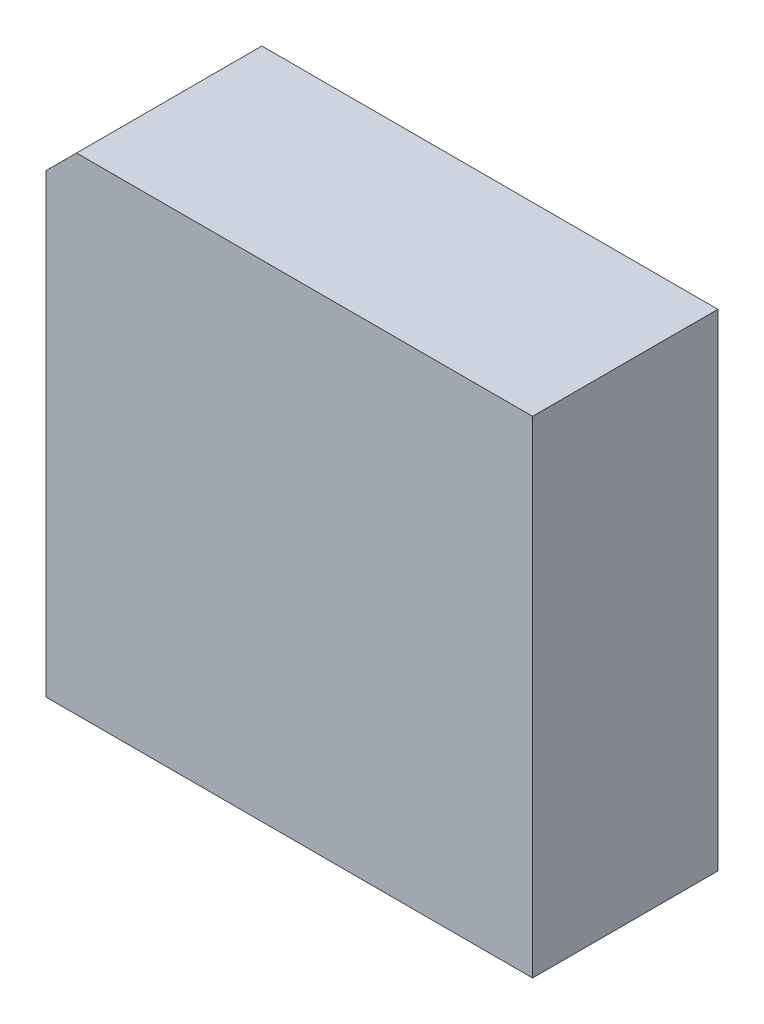
ISO-10303-21;
HEADER;
FILE_DESCRIPTION(('STEP AP214'),'2;1');
FILE_NAME('part.step','',(''),(''),'','','');
FILE_SCHEMA(('AUTOMOTIVE_DESIGN { 1 0 10303 214 1 1 1 1 }'));
ENDSEC;
DATA;
#1=APPLICATION_CONTEXT('core data for automotive mechanical design processes');
#2=APPLICATION_PROTOCOL_DEFINITION('international standard','automotive_design',2000,#1);
#3=PRODUCT_CONTEXT('',#1,'mechanical');
#4=PRODUCT('Part','Part','',(#3));
#5=PRODUCT_RELATED_PRODUCT_CATEGORY('part','',(#4));
#6=PRODUCT_DEFINITION_FORMATION('','',#4);
#7=PRODUCT_DEFINITION_CONTEXT('part definition',#1,'design');
#8=PRODUCT_DEFINITION('design','',#6,#7);
#9=PRODUCT_DEFINITION_SHAPE('','',#8);
#10=(LENGTH_UNIT() NAMED_UNIT(*) SI_UNIT(.MILLI.,.METRE.));
#11=(NAMED_UNIT(*) PLANE_ANGLE_UNIT() SI_UNIT($,.RADIAN.));
#12=(NAMED_UNIT(*) SI_UNIT($,.STERADIAN.) SOLID_ANGLE_UNIT());
#13=UNCERTAINTY_MEASURE_WITH_UNIT(LENGTH_MEASURE(1.E-05),#10,'distance_accuracy_value','');
#14=(GEOMETRIC_REPRESENTATION_CONTEXT(3) GLOBAL_UNCERTAINTY_ASSIGNED_CONTEXT((#13)) GLOBAL_UNIT_ASSIGNED_CONTEXT((#10,
#11,#12)) REPRESENTATION_CONTEXT('',''));
#15=CARTESIAN_POINT('',(0.,0.,0.));
#16=DIRECTION('',(0.,0.,1.));
#17=DIRECTION('',(1.,0.,0.));
#18=AXIS2_PLACEMENT_3D('',#15,#16,#17);
#19=CARTESIAN_POINT('',(38.6340124946602,48.3540000760838,0.70104));
#20=DIRECTION('',(0.707087840528548,-0.707125721337214,0.));
#21=DIRECTION('',(0.707125721337214,0.707087840528548,0.));
#22=AXIS2_PLACEMENT_3D('',#19,#20,#21);
#23=PLANE('',#22);
#24=DIRECTION('',(0.707125721337214,0.707087840528548,0.));
#25=VECTOR('',#24,1.);
#26=CARTESIAN_POINT('',(38.6340124946602,48.3540000760838,2.25552));
#27=LINE('',#26,#25);
#28=CARTESIAN_POINT('',(38.6395478794507,48.3595351643481,2.25552));
#29=VERTEX_POINT('',#28);
#30=CARTESIAN_POINT('',(38.8894905741092,48.6094644695492,2.25552));
#31=VERTEX_POINT('',#30);
#32=EDGE_CURVE('E20',#29,#31,#27,.T.);
#33=ORIENTED_EDGE('',*,*,#32,.T.);
#34=DIRECTION('',(0.,0.,-1.));
#35=VECTOR('',#34,1.);
#36=CARTESIAN_POINT('',(38.8894905741018,48.6094644695492,1.49352));
#37=LINE('',#36,#35);
#38=CARTESIAN_POINT('',(38.8894905741092,48.6094644695492,0.73152));
#39=VERTEX_POINT('',#38);
#40=EDGE_CURVE('E90',#31,#39,#37,.T.);
#41=ORIENTED_EDGE('',*,*,#40,.T.);
#42=DIRECTION('',(0.707125721337214,0.707087840528548,0.));
#43=VECTOR('',#42,1.);
#44=CARTESIAN_POINT('',(38.7645192267882,48.4844998169507,0.73152));
#45=LINE('',#44,#43);
#46=CARTESIAN_POINT('',(38.6395478794507,48.3595351643481,0.73152));
#47=VERTEX_POINT('',#46);
#48=EDGE_CURVE('E94',#47,#39,#45,.T.);
#49=ORIENTED_EDGE('',*,*,#48,.F.);
#50=DIRECTION('',(0.,0.,1.));
#51=VECTOR('',#50,1.);
#52=CARTESIAN_POINT('',(38.6395478794507,48.3595351643532,1.49352));
#53=LINE('',#52,#51);
#54=EDGE_CURVE('E88',#47,#29,#53,.T.);
#55=ORIENTED_EDGE('',*,*,#54,.T.);
#56=EDGE_LOOP('',(#33,#41,#49,#55));
#57=FACE_BOUND('',#56,.T.);
#58=ADVANCED_FACE('F16',(#57),#23,.F.);
#59=CARTESIAN_POINT('',(38.5594454485952,44.529370174,2.25552));
#60=DIRECTION('',(0.,0.,1.));
#61=DIRECTION('',(1.,0.,0.));
#62=AXIS2_PLACEMENT_3D('',#59,#60,#61);
#63=PLANE('',#62);
#64=ORIENTED_EDGE('',*,*,#32,.F.);
#65=DIRECTION('',(-2.67857431303977E-05,-0.999999999641262,0.));
#66=VECTOR('',#65,1.);
#67=CARTESIAN_POINT('',(38.6394976554323,46.4845071650263,2.25552));
#68=LINE('',#67,#66);
#69=CARTESIAN_POINT('',(38.6394474314148,44.6094791688719,2.25552));
#70=VERTEX_POINT('',#69);
#71=EDGE_CURVE('E83',#29,#70,#68,.T.);
#72=ORIENTED_EDGE('',*,*,#71,.T.);
#73=DIRECTION('',(0.999999999641262,-2.67857456870588E-05,0.));
#74=VECTOR('',#73,1.);
#75=CARTESIAN_POINT('',(40.6394434306915,44.6094255943054,2.25552));
#76=LINE('',#75,#74);
#77=CARTESIAN_POINT('',(42.6394394236391,44.6093720229331,2.25552));
#78=VERTEX_POINT('',#77);
#79=EDGE_CURVE('E79',#70,#78,#76,.T.);
#80=ORIENTED_EDGE('',*,*,#79,.T.);
#81=DIRECTION('',(2.67857456853907E-05,0.999999999641262,0.));
#82=VECTOR('',#81,1.);
#83=CARTESIAN_POINT('',(42.6394930013616,46.6093680222129,2.25552));
#84=LINE('',#83,#82);
#85=CARTESIAN_POINT('',(42.6395465727507,48.6093640183138,2.25552));
#86=VERTEX_POINT('',#85);
#87=EDGE_CURVE('E66',#78,#86,#84,.T.);
#88=ORIENTED_EDGE('',*,*,#87,.T.);
#89=DIRECTION('',(-0.999999999641262,2.67857496421854E-05,0.));
#90=VECTOR('',#89,1.);
#91=CARTESIAN_POINT('',(40.7645185734287,48.6094142455186,2.25552));
#92=LINE('',#91,#90);
#93=EDGE_CURVE('E92',#86,#31,#92,.T.);
#94=ORIENTED_EDGE('',*,*,#93,.T.);
#95=EDGE_LOOP('',(#64,#72,#80,#88,#94));
#96=FACE_BOUND('',#95,.T.);
#97=ADVANCED_FACE('F82',(#96),#63,.T.);
#98=CARTESIAN_POINT('',(42.6395487156012,48.6893638614636,0.70104));
#99=DIRECTION('',(-0.999999999641262,2.67857456853908E-05,0.));
#100=DIRECTION('',(-2.67857456853908E-05,-0.999999999641262,0.));
#101=AXIS2_PLACEMENT_3D('',#98,#99,#100);
#102=PLANE('',#101);
#103=ORIENTED_EDGE('',*,*,#87,.F.);
#104=DIRECTION('',(0.,0.,-1.));
#105=VECTOR('',#104,1.);
#106=CARTESIAN_POINT('',(42.639439429993,44.6093720229212,1.49352));
#107=LINE('',#106,#105);
#108=CARTESIAN_POINT('',(42.6394394299852,44.6093720229212,0.73152));
#109=VERTEX_POINT('',#108);
#110=EDGE_CURVE('E75',#78,#109,#107,.T.);
#111=ORIENTED_EDGE('',*,*,#110,.T.);
#112=DIRECTION('',(-2.67857456853908E-05,-0.999999999641262,0.));
#113=VECTOR('',#112,1.);
#114=CARTESIAN_POINT('',(42.6395487156012,48.6893638614636,0.73152));
#115=LINE('',#114,#113);
#116=CARTESIAN_POINT('',(42.6395465727507,48.609364021488,0.73152));
#117=VERTEX_POINT('',#116);
#118=EDGE_CURVE('E80',#109,#117,#115,.F.);
#119=ORIENTED_EDGE('',*,*,#118,.T.);
#120=DIRECTION('',(0.,0.,1.));
#121=VECTOR('',#120,1.);
#122=CARTESIAN_POINT('',(42.6395465727556,48.609364021488,1.49352));
#123=LINE('',#122,#121);
#124=EDGE_CURVE('E76',#117,#86,#123,.T.);
#125=ORIENTED_EDGE('',*,*,#124,.T.);
#126=EDGE_LOOP('',(#103,#111,#119,#125));
#127=FACE_BOUND('',#126,.T.);
#128=ADVANCED_FACE('F73',(#127),#102,.F.);
#129=CARTESIAN_POINT('',(38.8144894541272,48.6094664785104,0.70104));
#130=DIRECTION('',(-2.67857496421854E-05,-0.999999999641262,0.));
#131=DIRECTION('',(0.999999999641262,-2.67857496421854E-05,0.));
#132=AXIS2_PLACEMENT_3D('',#129,#130,#131);
#133=PLANE('',#132);
#134=ORIENTED_EDGE('',*,*,#93,.F.);
#135=ORIENTED_EDGE('',*,*,#124,.F.);
#136=DIRECTION('',(0.999999999641262,-2.67857496421854E-05,0.));
#137=VECTOR('',#136,1.);
#138=CARTESIAN_POINT('',(38.8144894541272,48.6094664785104,0.73152));
#139=LINE('',#138,#137);
#140=EDGE_CURVE('E99',#117,#39,#139,.F.);
#141=ORIENTED_EDGE('',*,*,#140,.T.);
#142=ORIENTED_EDGE('',*,*,#40,.F.);
#143=EDGE_LOOP('',(#134,#135,#141,#142));
#144=FACE_BOUND('',#143,.T.);
#145=ADVANCED_FACE('F105',(#144),#133,.F.);
#146=CARTESIAN_POINT('',(38.6394454224532,44.5344780457248,0.70104));
#147=DIRECTION('',(0.999999999641262,-2.67857431303977E-05,0.));
#148=DIRECTION('',(2.67857431303977E-05,0.999999999641262,0.));
#149=AXIS2_PLACEMENT_3D('',#146,#147,#148);
#150=PLANE('',#149);
#151=ORIENTED_EDGE('',*,*,#71,.F.);
#152=ORIENTED_EDGE('',*,*,#54,.F.);
#153=DIRECTION('',(2.67857431303977E-05,0.999999999641262,0.));
#154=VECTOR('',#153,1.);
#155=CARTESIAN_POINT('',(38.6394454224532,44.5344780457248,0.73152));
#156=LINE('',#155,#154);
#157=CARTESIAN_POINT('',(38.6394474314147,44.6094791656896,0.73152));
#158=VERTEX_POINT('',#157);
#159=EDGE_CURVE('E26',#47,#158,#156,.F.);
#160=ORIENTED_EDGE('',*,*,#159,.T.);
#161=DIRECTION('',(0.,0.,1.));
#162=VECTOR('',#161,1.);
#163=CARTESIAN_POINT('',(38.6394474314154,44.6094791656896,1.49352));
#164=LINE('',#163,#162);
#165=EDGE_CURVE('E34',#158,#70,#164,.T.);
#166=ORIENTED_EDGE('',*,*,#165,.T.);
#167=EDGE_LOOP('',(#151,#152,#160,#166));
#168=FACE_BOUND('',#167,.T.);
#169=ADVANCED_FACE('F108',(#168),#150,.F.);
#170=CARTESIAN_POINT('',(42.7194392699422,44.6093698800658,0.70104));
#171=DIRECTION('',(2.67857456870588E-05,0.999999999641262,0.));
#172=DIRECTION('',(-0.999999999641262,2.67857456870588E-05,0.));
#173=AXIS2_PLACEMENT_3D('',#170,#171,#172);
#174=PLANE('',#173);
#175=ORIENTED_EDGE('',*,*,#79,.F.);
#176=ORIENTED_EDGE('',*,*,#165,.F.);
#177=DIRECTION('',(-0.999999999641262,2.67857456870588E-05,0.));
#178=VECTOR('',#177,1.);
#179=CARTESIAN_POINT('',(42.7194392699422,44.6093698800658,0.73152));
#180=LINE('',#179,#178);
#181=EDGE_CURVE('E11',#158,#109,#180,.F.);
#182=ORIENTED_EDGE('',*,*,#181,.T.);
#183=ORIENTED_EDGE('',*,*,#110,.F.);
#184=EDGE_LOOP('',(#175,#176,#182,#183));
#185=FACE_BOUND('',#184,.T.);
#186=ADVANCED_FACE('F78',(#185),#174,.F.);
#187=CARTESIAN_POINT('',(38.5594454485952,44.529370174,0.73152));
#188=DIRECTION('',(0.,0.,1.));
#189=DIRECTION('',(1.,0.,0.));
#190=AXIS2_PLACEMENT_3D('',#187,#188,#189);
#191=PLANE('',#190);
#192=ORIENTED_EDGE('',*,*,#159,.F.);
#193=ORIENTED_EDGE('',*,*,#48,.T.);
#194=ORIENTED_EDGE('',*,*,#140,.F.);
#195=ORIENTED_EDGE('',*,*,#118,.F.);
#196=ORIENTED_EDGE('',*,*,#181,.F.);
#197=EDGE_LOOP('',(#192,#193,#194,#195,#196));
#198=FACE_BOUND('',#197,.T.);
#199=ADVANCED_FACE('F18',(#198),#191,.F.);
#200=CLOSED_SHELL('',(#58,#97,#128,#145,#169,#186,#199));
#201=MANIFOLD_SOLID_BREP('B1',#200);
#202=ADVANCED_BREP_SHAPE_REPRESENTATION('',(#18,#201),#14);
#203=SHAPE_DEFINITION_REPRESENTATION(#9,#202);
ENDSEC;
END-ISO-10303-21;
